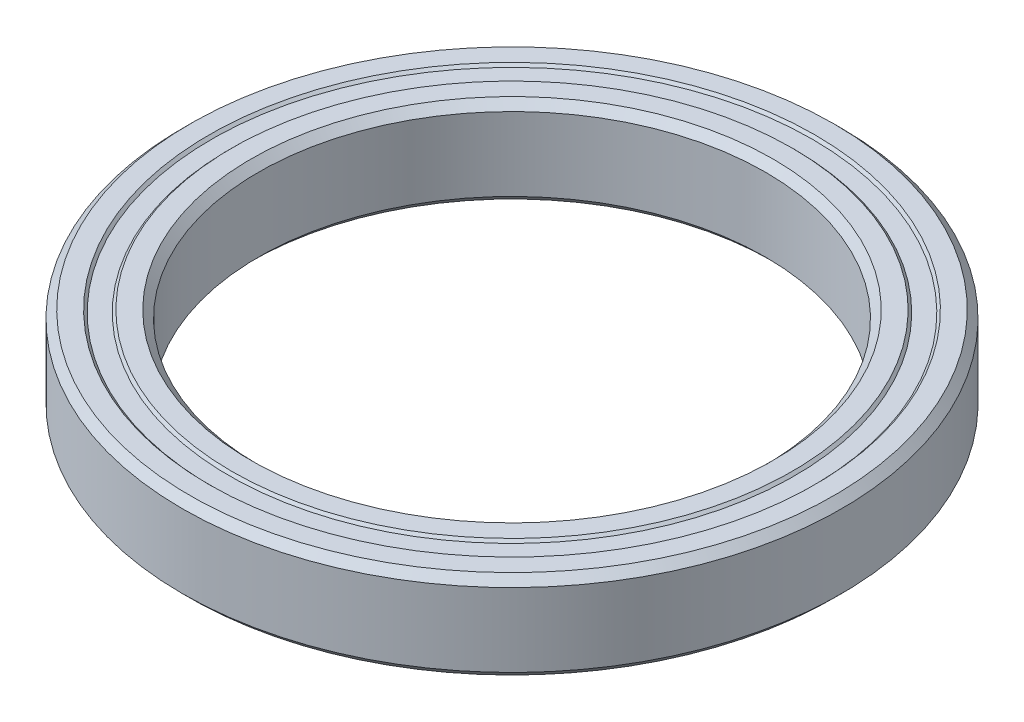
ISO-10303-21;
HEADER;
FILE_DESCRIPTION(('STEP AP214'),'2;1');
FILE_NAME('part.step','',(''),(''),'','','');
FILE_SCHEMA(('AUTOMOTIVE_DESIGN { 1 0 10303 214 1 1 1 1 }'));
ENDSEC;
DATA;
#1=APPLICATION_CONTEXT('core data for automotive mechanical design processes');
#2=APPLICATION_PROTOCOL_DEFINITION('international standard','automotive_design',2000,#1);
#3=PRODUCT_CONTEXT('',#1,'mechanical');
#4=PRODUCT('Part','Part','',(#3));
#5=PRODUCT_RELATED_PRODUCT_CATEGORY('part','',(#4));
#6=PRODUCT_DEFINITION_FORMATION('','',#4);
#7=PRODUCT_DEFINITION_CONTEXT('part definition',#1,'design');
#8=PRODUCT_DEFINITION('design','',#6,#7);
#9=PRODUCT_DEFINITION_SHAPE('','',#8);
#10=(LENGTH_UNIT() NAMED_UNIT(*) SI_UNIT(.MILLI.,.METRE.));
#11=(NAMED_UNIT(*) PLANE_ANGLE_UNIT() SI_UNIT($,.RADIAN.));
#12=(NAMED_UNIT(*) SI_UNIT($,.STERADIAN.) SOLID_ANGLE_UNIT());
#13=UNCERTAINTY_MEASURE_WITH_UNIT(LENGTH_MEASURE(1.E-05),#10,'distance_accuracy_value','');
#14=(GEOMETRIC_REPRESENTATION_CONTEXT(3) GLOBAL_UNCERTAINTY_ASSIGNED_CONTEXT((#13)) GLOBAL_UNIT_ASSIGNED_CONTEXT((#10,
#11,#12)) REPRESENTATION_CONTEXT('',''));
#15=CARTESIAN_POINT('',(0.,0.,0.));
#16=DIRECTION('',(0.,0.,1.));
#17=DIRECTION('',(1.,0.,0.));
#18=AXIS2_PLACEMENT_3D('',#15,#16,#17);
#19=CARTESIAN_POINT('',(0.,3.49999999999999,0.));
#20=DIRECTION('',(0.,1.,0.));
#21=DIRECTION('',(0.,0.,1.));
#22=AXIS2_PLACEMENT_3D('',#19,#20,#21);
#23=CONICAL_SURFACE('',#22,20.6,0.785398163397469);
#24=CARTESIAN_POINT('',(0.,2.90000000000002,0.));
#25=DIRECTION('',(0.,-1.,0.));
#26=DIRECTION('',(0.,0.,-1.));
#27=AXIS2_PLACEMENT_3D('',#24,#25,#26);
#28=CIRCLE('',#27,20.);
#29=CARTESIAN_POINT('',(0.,2.90000000000002,-20.));
#30=VERTEX_POINT('',#29);
#31=EDGE_CURVE('E10',#30,#30,#28,.T.);
#32=ORIENTED_EDGE('',*,*,#31,.T.);
#33=EDGE_LOOP('',(#32));
#34=FACE_BOUND('',#33,.T.);
#35=CARTESIAN_POINT('',(0.,3.49999999999999,0.));
#36=DIRECTION('',(0.,-1.,0.));
#37=DIRECTION('',(0.,0.,-1.));
#38=AXIS2_PLACEMENT_3D('',#35,#36,#37);
#39=CIRCLE('',#38,20.6);
#40=CARTESIAN_POINT('',(0.,3.49999999999999,-20.6));
#41=VERTEX_POINT('',#40);
#42=EDGE_CURVE('E88',#41,#41,#39,.T.);
#43=ORIENTED_EDGE('',*,*,#42,.F.);
#44=EDGE_LOOP('',(#43));
#45=FACE_BOUND('',#44,.T.);
#46=ADVANCED_FACE('F36',(#34,#45),#23,.F.);
#47=CARTESIAN_POINT('',(0.,-1.34942197217015,0.));
#48=DIRECTION('',(0.,-1.,0.));
#49=DIRECTION('',(0.,0.,-1.));
#50=AXIS2_PLACEMENT_3D('',#47,#48,#49);
#51=CYLINDRICAL_SURFACE('',#50,20.);
#52=CARTESIAN_POINT('',(0.,-2.90000000000002,0.));
#53=DIRECTION('',(0.,-1.,0.));
#54=DIRECTION('',(0.,0.,-1.));
#55=AXIS2_PLACEMENT_3D('',#52,#53,#54);
#56=CIRCLE('',#55,20.);
#57=CARTESIAN_POINT('',(0.,-2.90000000000002,-20.));
#58=VERTEX_POINT('',#57);
#59=EDGE_CURVE('E42',#58,#58,#56,.T.);
#60=ORIENTED_EDGE('',*,*,#59,.T.);
#61=EDGE_LOOP('',(#60));
#62=FACE_BOUND('',#61,.T.);
#63=ORIENTED_EDGE('',*,*,#31,.F.);
#64=EDGE_LOOP('',(#63));
#65=FACE_BOUND('',#64,.T.);
#66=ADVANCED_FACE('F96',(#62,#65),#51,.F.);
#67=CARTESIAN_POINT('',(0.,-2.90000000000002,0.));
#68=DIRECTION('',(0.,-1.,0.));
#69=DIRECTION('',(0.,0.,-1.));
#70=AXIS2_PLACEMENT_3D('',#67,#68,#69);
#71=CONICAL_SURFACE('',#70,20.,0.785398163397434);
#72=CARTESIAN_POINT('',(0.,-3.50000000000001,0.));
#73=DIRECTION('',(0.,-1.,0.));
#74=DIRECTION('',(0.,0.,-1.));
#75=AXIS2_PLACEMENT_3D('',#72,#73,#74);
#76=CIRCLE('',#75,20.6);
#77=CARTESIAN_POINT('',(0.,-3.50000000000001,-20.6));
#78=VERTEX_POINT('',#77);
#79=EDGE_CURVE('E46',#78,#78,#76,.T.);
#80=ORIENTED_EDGE('',*,*,#79,.T.);
#81=EDGE_LOOP('',(#80));
#82=FACE_BOUND('',#81,.T.);
#83=ORIENTED_EDGE('',*,*,#59,.F.);
#84=EDGE_LOOP('',(#83));
#85=FACE_BOUND('',#84,.T.);
#86=ADVANCED_FACE('F100',(#82,#85),#71,.F.);
#87=CARTESIAN_POINT('',(20.6,-3.50000000000001,0.));
#88=DIRECTION('',(0.,-1.,0.));
#89=DIRECTION('',(0.,0.,-1.));
#90=AXIS2_PLACEMENT_3D('',#87,#88,#89);
#91=PLANE('',#90);
#92=CARTESIAN_POINT('',(0.,-3.50000000000001,0.));
#93=DIRECTION('',(0.,-1.,0.));
#94=DIRECTION('',(0.,0.,-1.));
#95=AXIS2_PLACEMENT_3D('',#92,#93,#94);
#96=CIRCLE('',#95,22.1);
#97=CARTESIAN_POINT('',(0.,-3.50000000000001,-22.1));
#98=VERTEX_POINT('',#97);
#99=EDGE_CURVE('E50',#98,#98,#96,.T.);
#100=ORIENTED_EDGE('',*,*,#99,.T.);
#101=EDGE_LOOP('',(#100));
#102=FACE_BOUND('',#101,.T.);
#103=ORIENTED_EDGE('',*,*,#79,.F.);
#104=EDGE_LOOP('',(#103));
#105=FACE_BOUND('',#104,.T.);
#106=ADVANCED_FACE('F104',(#102,#105),#91,.T.);
#107=CARTESIAN_POINT('',(0.,-3.50000000000001,0.));
#108=DIRECTION('',(0.,1.,0.));
#109=DIRECTION('',(0.,0.,1.));
#110=AXIS2_PLACEMENT_3D('',#107,#108,#109);
#111=CONICAL_SURFACE('',#110,22.1,0.785398163397404);
#112=CARTESIAN_POINT('',(0.,-3.3,0.));
#113=DIRECTION('',(0.,-1.,0.));
#114=DIRECTION('',(0.,0.,-1.));
#115=AXIS2_PLACEMENT_3D('',#112,#113,#114);
#116=CIRCLE('',#115,22.3);
#117=CARTESIAN_POINT('',(0.,-3.3,-22.3));
#118=VERTEX_POINT('',#117);
#119=EDGE_CURVE('E55',#118,#118,#116,.T.);
#120=ORIENTED_EDGE('',*,*,#119,.T.);
#121=EDGE_LOOP('',(#120));
#122=FACE_BOUND('',#121,.T.);
#123=ORIENTED_EDGE('',*,*,#99,.F.);
#124=EDGE_LOOP('',(#123));
#125=FACE_BOUND('',#124,.T.);
#126=ADVANCED_FACE('F111',(#122,#125),#111,.T.);
#127=CARTESIAN_POINT('',(22.3,-3.3,0.));
#128=DIRECTION('',(0.,-1.,0.));
#129=DIRECTION('',(0.,0.,-1.));
#130=AXIS2_PLACEMENT_3D('',#127,#128,#129);
#131=PLANE('',#130);
#132=CARTESIAN_POINT('',(0.,-3.3,0.));
#133=DIRECTION('',(0.,-1.,0.));
#134=DIRECTION('',(0.,0.,-1.));
#135=AXIS2_PLACEMENT_3D('',#132,#133,#134);
#136=CIRCLE('',#135,23.7);
#137=CARTESIAN_POINT('',(0.,-3.3,-23.7));
#138=VERTEX_POINT('',#137);
#139=EDGE_CURVE('E58',#138,#138,#136,.T.);
#140=ORIENTED_EDGE('',*,*,#139,.T.);
#141=EDGE_LOOP('',(#140));
#142=FACE_BOUND('',#141,.T.);
#143=ORIENTED_EDGE('',*,*,#119,.F.);
#144=EDGE_LOOP('',(#143));
#145=FACE_BOUND('',#144,.T.);
#146=ADVANCED_FACE('F115',(#142,#145),#131,.T.);
#147=CARTESIAN_POINT('',(0.,-3.3,0.));
#148=DIRECTION('',(0.,-1.,0.));
#149=DIRECTION('',(0.,0.,-1.));
#150=AXIS2_PLACEMENT_3D('',#147,#148,#149);
#151=CONICAL_SURFACE('',#150,23.7,0.785398163397396);
#152=CARTESIAN_POINT('',(0.,-3.50000000000001,0.));
#153=DIRECTION('',(0.,-1.,0.));
#154=DIRECTION('',(0.,0.,-1.));
#155=AXIS2_PLACEMENT_3D('',#152,#153,#154);
#156=CIRCLE('',#155,23.9);
#157=CARTESIAN_POINT('',(0.,-3.50000000000001,-23.9));
#158=VERTEX_POINT('',#157);
#159=EDGE_CURVE('E61',#158,#158,#156,.T.);
#160=ORIENTED_EDGE('',*,*,#159,.T.);
#161=EDGE_LOOP('',(#160));
#162=FACE_BOUND('',#161,.T.);
#163=ORIENTED_EDGE('',*,*,#139,.F.);
#164=EDGE_LOOP('',(#163));
#165=FACE_BOUND('',#164,.T.);
#166=ADVANCED_FACE('F119',(#162,#165),#151,.F.);
#167=CARTESIAN_POINT('',(23.9,-3.50000000000001,0.));
#168=DIRECTION('',(0.,-1.,0.));
#169=DIRECTION('',(0.,0.,-1.));
#170=AXIS2_PLACEMENT_3D('',#167,#168,#169);
#171=PLANE('',#170);
#172=CARTESIAN_POINT('',(0.,-3.50000000000001,0.));
#173=DIRECTION('',(0.,-1.,0.));
#174=DIRECTION('',(0.,0.,-1.));
#175=AXIS2_PLACEMENT_3D('',#172,#173,#174);
#176=CIRCLE('',#175,25.4);
#177=CARTESIAN_POINT('',(0.,-3.50000000000001,-25.4));
#178=VERTEX_POINT('',#177);
#179=EDGE_CURVE('E64',#178,#178,#176,.T.);
#180=ORIENTED_EDGE('',*,*,#179,.T.);
#181=EDGE_LOOP('',(#180));
#182=FACE_BOUND('',#181,.T.);
#183=ORIENTED_EDGE('',*,*,#159,.F.);
#184=EDGE_LOOP('',(#183));
#185=FACE_BOUND('',#184,.T.);
#186=ADVANCED_FACE('F123',(#182,#185),#171,.T.);
#187=CARTESIAN_POINT('',(0.,-3.50000000000001,0.));
#188=DIRECTION('',(0.,1.,0.));
#189=DIRECTION('',(0.,0.,1.));
#190=AXIS2_PLACEMENT_3D('',#187,#188,#189);
#191=CONICAL_SURFACE('',#190,25.4,0.785398163397447);
#192=CARTESIAN_POINT('',(0.,-2.90000000000003,0.));
#193=DIRECTION('',(0.,-1.,0.));
#194=DIRECTION('',(0.,0.,-1.));
#195=AXIS2_PLACEMENT_3D('',#192,#193,#194);
#196=CIRCLE('',#195,26.);
#197=CARTESIAN_POINT('',(0.,-2.90000000000003,-26.));
#198=VERTEX_POINT('',#197);
#199=EDGE_CURVE('E67',#198,#198,#196,.T.);
#200=ORIENTED_EDGE('',*,*,#199,.T.);
#201=EDGE_LOOP('',(#200));
#202=FACE_BOUND('',#201,.T.);
#203=ORIENTED_EDGE('',*,*,#179,.F.);
#204=EDGE_LOOP('',(#203));
#205=FACE_BOUND('',#204,.T.);
#206=ADVANCED_FACE('F127',(#202,#205),#191,.T.);
#207=CARTESIAN_POINT('',(0.,-1.34942197217015,0.));
#208=DIRECTION('',(0.,-1.,0.));
#209=DIRECTION('',(0.,0.,-1.));
#210=AXIS2_PLACEMENT_3D('',#207,#208,#209);
#211=CYLINDRICAL_SURFACE('',#210,26.);
#212=CARTESIAN_POINT('',(0.,2.90000000000001,0.));
#213=DIRECTION('',(0.,-1.,0.));
#214=DIRECTION('',(0.,0.,-1.));
#215=AXIS2_PLACEMENT_3D('',#212,#213,#214);
#216=CIRCLE('',#215,26.);
#217=CARTESIAN_POINT('',(0.,2.90000000000001,-26.));
#218=VERTEX_POINT('',#217);
#219=EDGE_CURVE('E70',#218,#218,#216,.T.);
#220=ORIENTED_EDGE('',*,*,#219,.T.);
#221=EDGE_LOOP('',(#220));
#222=FACE_BOUND('',#221,.T.);
#223=ORIENTED_EDGE('',*,*,#199,.F.);
#224=EDGE_LOOP('',(#223));
#225=FACE_BOUND('',#224,.T.);
#226=ADVANCED_FACE('F131',(#222,#225),#211,.T.);
#227=CARTESIAN_POINT('',(0.,2.90000000000001,0.));
#228=DIRECTION('',(0.,-1.,0.));
#229=DIRECTION('',(0.,0.,-1.));
#230=AXIS2_PLACEMENT_3D('',#227,#228,#229);
#231=CONICAL_SURFACE('',#230,26.,0.785398163397445);
#232=CARTESIAN_POINT('',(0.,3.49999999999999,0.));
#233=DIRECTION('',(0.,-1.,0.));
#234=DIRECTION('',(0.,0.,-1.));
#235=AXIS2_PLACEMENT_3D('',#232,#233,#234);
#236=CIRCLE('',#235,25.4);
#237=CARTESIAN_POINT('',(0.,3.49999999999999,-25.4));
#238=VERTEX_POINT('',#237);
#239=EDGE_CURVE('E73',#238,#238,#236,.T.);
#240=ORIENTED_EDGE('',*,*,#239,.T.);
#241=EDGE_LOOP('',(#240));
#242=FACE_BOUND('',#241,.T.);
#243=ORIENTED_EDGE('',*,*,#219,.F.);
#244=EDGE_LOOP('',(#243));
#245=FACE_BOUND('',#244,.T.);
#246=ADVANCED_FACE('F135',(#242,#245),#231,.T.);
#247=CARTESIAN_POINT('',(25.4,3.49999999999999,0.));
#248=DIRECTION('',(0.,1.,0.));
#249=DIRECTION('',(0.,0.,1.));
#250=AXIS2_PLACEMENT_3D('',#247,#248,#249);
#251=PLANE('',#250);
#252=CARTESIAN_POINT('',(0.,3.49999999999999,0.));
#253=DIRECTION('',(0.,-1.,0.));
#254=DIRECTION('',(0.,0.,-1.));
#255=AXIS2_PLACEMENT_3D('',#252,#253,#254);
#256=CIRCLE('',#255,23.9);
#257=CARTESIAN_POINT('',(0.,3.49999999999999,-23.9));
#258=VERTEX_POINT('',#257);
#259=EDGE_CURVE('E76',#258,#258,#256,.T.);
#260=ORIENTED_EDGE('',*,*,#259,.T.);
#261=EDGE_LOOP('',(#260));
#262=FACE_BOUND('',#261,.T.);
#263=ORIENTED_EDGE('',*,*,#239,.F.);
#264=EDGE_LOOP('',(#263));
#265=FACE_BOUND('',#264,.T.);
#266=ADVANCED_FACE('F139',(#262,#265),#251,.T.);
#267=CARTESIAN_POINT('',(0.,3.49999999999999,0.));
#268=DIRECTION('',(0.,1.,0.));
#269=DIRECTION('',(0.,0.,1.));
#270=AXIS2_PLACEMENT_3D('',#267,#268,#269);
#271=CONICAL_SURFACE('',#270,23.9,0.785398163397431);
#272=CARTESIAN_POINT('',(0.,3.29999999999999,0.));
#273=DIRECTION('',(0.,-1.,0.));
#274=DIRECTION('',(0.,0.,-1.));
#275=AXIS2_PLACEMENT_3D('',#272,#273,#274);
#276=CIRCLE('',#275,23.7);
#277=CARTESIAN_POINT('',(0.,3.29999999999999,-23.7));
#278=VERTEX_POINT('',#277);
#279=EDGE_CURVE('E79',#278,#278,#276,.T.);
#280=ORIENTED_EDGE('',*,*,#279,.T.);
#281=EDGE_LOOP('',(#280));
#282=FACE_BOUND('',#281,.T.);
#283=ORIENTED_EDGE('',*,*,#259,.F.);
#284=EDGE_LOOP('',(#283));
#285=FACE_BOUND('',#284,.T.);
#286=ADVANCED_FACE('F143',(#282,#285),#271,.F.);
#287=CARTESIAN_POINT('',(23.7,3.29999999999999,0.));
#288=DIRECTION('',(0.,1.,0.));
#289=DIRECTION('',(0.,0.,1.));
#290=AXIS2_PLACEMENT_3D('',#287,#288,#289);
#291=PLANE('',#290);
#292=CARTESIAN_POINT('',(0.,3.3,0.));
#293=DIRECTION('',(0.,-1.,0.));
#294=DIRECTION('',(0.,0.,-1.));
#295=AXIS2_PLACEMENT_3D('',#292,#293,#294);
#296=CIRCLE('',#295,22.3);
#297=CARTESIAN_POINT('',(0.,3.3,-22.3));
#298=VERTEX_POINT('',#297);
#299=EDGE_CURVE('E82',#298,#298,#296,.T.);
#300=ORIENTED_EDGE('',*,*,#299,.T.);
#301=EDGE_LOOP('',(#300));
#302=FACE_BOUND('',#301,.T.);
#303=ORIENTED_EDGE('',*,*,#279,.F.);
#304=EDGE_LOOP('',(#303));
#305=FACE_BOUND('',#304,.T.);
#306=ADVANCED_FACE('F147',(#302,#305),#291,.T.);
#307=CARTESIAN_POINT('',(0.,3.3,0.));
#308=DIRECTION('',(0.,-1.,0.));
#309=DIRECTION('',(0.,0.,-1.));
#310=AXIS2_PLACEMENT_3D('',#307,#308,#309);
#311=CONICAL_SURFACE('',#310,22.3,0.785398163397461);
#312=CARTESIAN_POINT('',(0.,3.49999999999999,0.));
#313=DIRECTION('',(0.,-1.,0.));
#314=DIRECTION('',(0.,0.,-1.));
#315=AXIS2_PLACEMENT_3D('',#312,#313,#314);
#316=CIRCLE('',#315,22.1);
#317=CARTESIAN_POINT('',(0.,3.49999999999999,-22.1));
#318=VERTEX_POINT('',#317);
#319=EDGE_CURVE('E85',#318,#318,#316,.T.);
#320=ORIENTED_EDGE('',*,*,#319,.T.);
#321=EDGE_LOOP('',(#320));
#322=FACE_BOUND('',#321,.T.);
#323=ORIENTED_EDGE('',*,*,#299,.F.);
#324=EDGE_LOOP('',(#323));
#325=FACE_BOUND('',#324,.T.);
#326=ADVANCED_FACE('F151',(#322,#325),#311,.T.);
#327=CARTESIAN_POINT('',(22.1,3.49999999999999,0.));
#328=DIRECTION('',(0.,1.,0.));
#329=DIRECTION('',(0.,0.,1.));
#330=AXIS2_PLACEMENT_3D('',#327,#328,#329);
#331=PLANE('',#330);
#332=ORIENTED_EDGE('',*,*,#42,.T.);
#333=EDGE_LOOP('',(#332));
#334=FACE_BOUND('',#333,.T.);
#335=ORIENTED_EDGE('',*,*,#319,.F.);
#336=EDGE_LOOP('',(#335));
#337=FACE_BOUND('',#336,.T.);
#338=ADVANCED_FACE('F92',(#334,#337),#331,.T.);
#339=CLOSED_SHELL('',(#46,#66,#86,#106,#126,#146,#166,#186,#206,#226,#246,#266,#286,#306,#326,#338));
#340=MANIFOLD_SOLID_BREP('B2',#339);
#341=ADVANCED_BREP_SHAPE_REPRESENTATION('',(#18,#340),#14);
#342=SHAPE_DEFINITION_REPRESENTATION(#9,#341);
ENDSEC;
END-ISO-10303-21;
